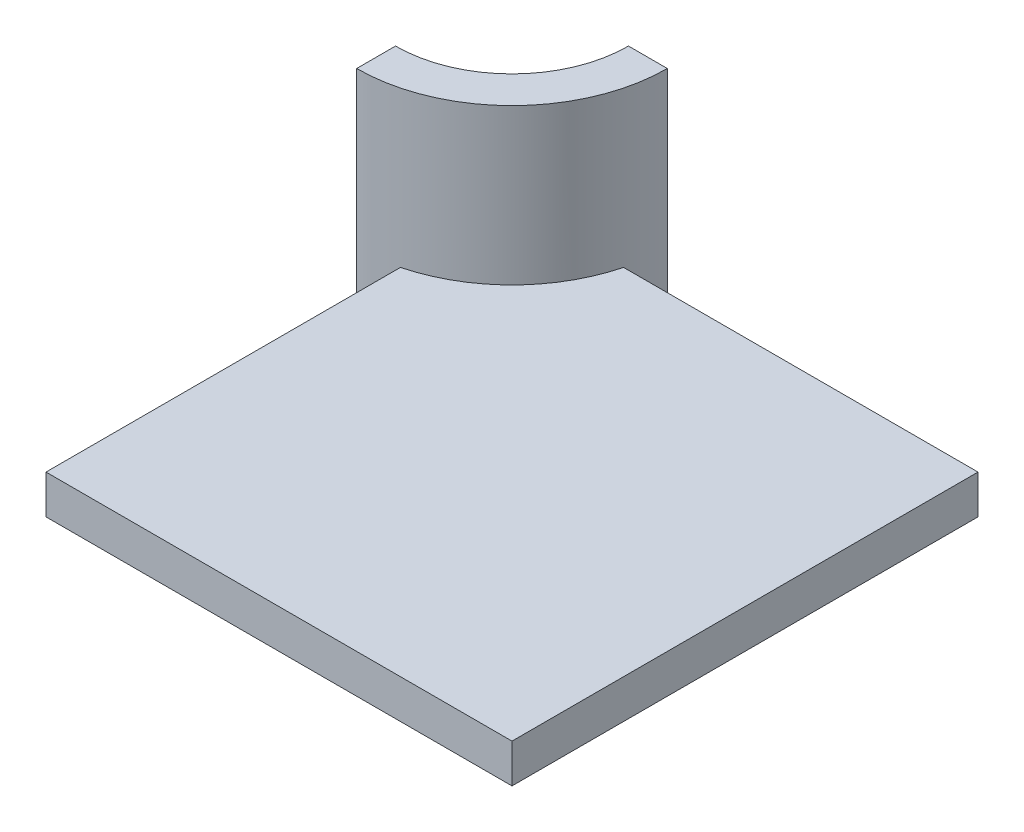
ISO-10303-21;
HEADER;
FILE_DESCRIPTION(('STEP AP214'),'2;1');
FILE_NAME('part.step','',(''),(''),'','','');
FILE_SCHEMA(('AUTOMOTIVE_DESIGN { 1 0 10303 214 1 1 1 1 }'));
ENDSEC;
DATA;
#1=APPLICATION_CONTEXT('core data for automotive mechanical design processes');
#2=APPLICATION_PROTOCOL_DEFINITION('international standard','automotive_design',2000,#1);
#3=PRODUCT_CONTEXT('',#1,'mechanical');
#4=PRODUCT('Part','Part','',(#3));
#5=PRODUCT_RELATED_PRODUCT_CATEGORY('part','',(#4));
#6=PRODUCT_DEFINITION_FORMATION('','',#4);
#7=PRODUCT_DEFINITION_CONTEXT('part definition',#1,'design');
#8=PRODUCT_DEFINITION('design','',#6,#7);
#9=PRODUCT_DEFINITION_SHAPE('','',#8);
#10=(LENGTH_UNIT() NAMED_UNIT(*) SI_UNIT(.MILLI.,.METRE.));
#11=(NAMED_UNIT(*) PLANE_ANGLE_UNIT() SI_UNIT($,.RADIAN.));
#12=(NAMED_UNIT(*) SI_UNIT($,.STERADIAN.) SOLID_ANGLE_UNIT());
#13=UNCERTAINTY_MEASURE_WITH_UNIT(LENGTH_MEASURE(1.E-05),#10,'distance_accuracy_value','');
#14=(GEOMETRIC_REPRESENTATION_CONTEXT(3) GLOBAL_UNCERTAINTY_ASSIGNED_CONTEXT((#13)) GLOBAL_UNIT_ASSIGNED_CONTEXT((#10,
#11,#12)) REPRESENTATION_CONTEXT('',''));
#15=CARTESIAN_POINT('',(0.,0.,0.));
#16=DIRECTION('',(0.,0.,1.));
#17=DIRECTION('',(1.,0.,0.));
#18=AXIS2_PLACEMENT_3D('',#15,#16,#17);
#19=CARTESIAN_POINT('',(-1.25,-0.05,-1.));
#20=DIRECTION('',(0.,1.,0.));
#21=DIRECTION('',(0.,0.,-1.));
#22=AXIS2_PLACEMENT_3D('',#19,#20,#21);
#23=CYLINDRICAL_SURFACE('',#22,0.2);
#24=DIRECTION('',(0.,1.,0.));
#25=VECTOR('',#24,1.);
#26=CARTESIAN_POINT('',(-1.05635083268963,-0.898528137423858,-0.95));
#27=LINE('',#26,#25);
#28=CARTESIAN_POINT('',(-1.05635083268963,-0.05,-0.95));
#29=VERTEX_POINT('',#28);
#30=CARTESIAN_POINT('',(-1.05635083268963,0.,-0.95));
#31=VERTEX_POINT('',#30);
#32=EDGE_CURVE('E11',#29,#31,#27,.T.);
#33=ORIENTED_EDGE('',*,*,#32,.F.);
#34=CARTESIAN_POINT('',(-1.25,-0.05,-1.));
#35=DIRECTION('',(0.,-1.,0.));
#36=DIRECTION('',(0.,0.,1.));
#37=AXIS2_PLACEMENT_3D('',#34,#35,#36);
#38=CIRCLE('',#37,0.2);
#39=CARTESIAN_POINT('',(-1.05,-0.05,-1.));
#40=VERTEX_POINT('',#39);
#41=EDGE_CURVE('E24',#40,#29,#38,.T.);
#42=ORIENTED_EDGE('',*,*,#41,.F.);
#43=DIRECTION('',(0.,1.,0.));
#44=VECTOR('',#43,1.);
#45=CARTESIAN_POINT('',(-1.05,-0.05,-1.));
#46=LINE('',#45,#44);
#47=CARTESIAN_POINT('',(-1.05,0.2,-1.));
#48=VERTEX_POINT('',#47);
#49=EDGE_CURVE('E158',#40,#48,#46,.T.);
#50=ORIENTED_EDGE('',*,*,#49,.T.);
#51=CARTESIAN_POINT('',(-1.25,0.2,-1.));
#52=DIRECTION('',(0.,-1.,0.));
#53=DIRECTION('',(0.,0.,1.));
#54=AXIS2_PLACEMENT_3D('',#51,#52,#53);
#55=CIRCLE('',#54,0.2);
#56=CARTESIAN_POINT('',(-1.25,0.2,-0.8));
#57=VERTEX_POINT('',#56);
#58=EDGE_CURVE('E156',#48,#57,#55,.T.);
#59=ORIENTED_EDGE('',*,*,#58,.T.);
#60=DIRECTION('',(0.,1.,0.));
#61=VECTOR('',#60,1.);
#62=CARTESIAN_POINT('',(-1.25,-0.05,-0.8));
#63=LINE('',#62,#61);
#64=CARTESIAN_POINT('',(-1.25,-0.05,-0.8));
#65=VERTEX_POINT('',#64);
#66=EDGE_CURVE('E153',#65,#57,#63,.T.);
#67=ORIENTED_EDGE('',*,*,#66,.F.);
#68=CARTESIAN_POINT('',(-1.25,-0.05,-1.));
#69=DIRECTION('',(0.,-1.,0.));
#70=DIRECTION('',(0.,0.,1.));
#71=AXIS2_PLACEMENT_3D('',#68,#69,#70);
#72=CIRCLE('',#71,0.2);
#73=CARTESIAN_POINT('',(-1.2,-0.05,-0.806350832689629));
#74=VERTEX_POINT('',#73);
#75=EDGE_CURVE('E150',#74,#65,#72,.T.);
#76=ORIENTED_EDGE('',*,*,#75,.F.);
#77=DIRECTION('',(0.,1.,0.));
#78=VECTOR('',#77,1.);
#79=CARTESIAN_POINT('',(-1.2,-0.898528137423858,-0.806350832689629));
#80=LINE('',#79,#78);
#81=CARTESIAN_POINT('',(-1.2,0.,-0.806350832689629));
#82=VERTEX_POINT('',#81);
#83=EDGE_CURVE('E148',#74,#82,#80,.T.);
#84=ORIENTED_EDGE('',*,*,#83,.T.);
#85=CARTESIAN_POINT('',(-1.25,0.,-1.));
#86=DIRECTION('',(0.,1.,0.));
#87=DIRECTION('',(0.,0.,1.));
#88=AXIS2_PLACEMENT_3D('',#85,#86,#87);
#89=CIRCLE('',#88,0.2);
#90=EDGE_CURVE('E107',#82,#31,#89,.T.);
#91=ORIENTED_EDGE('',*,*,#90,.T.);
#92=EDGE_LOOP('',(#33,#42,#50,#59,#67,#76,#84,#91));
#93=FACE_BOUND('',#92,.T.);
#94=ADVANCED_FACE('F17',(#93),#23,.T.);
#95=CARTESIAN_POINT('',(-1.25,-0.05,-1.));
#96=DIRECTION('',(0.,1.,0.));
#97=DIRECTION('',(0.,0.,-1.));
#98=AXIS2_PLACEMENT_3D('',#95,#96,#97);
#99=CYLINDRICAL_SURFACE('',#98,0.15);
#100=DIRECTION('',(0.,1.,0.));
#101=VECTOR('',#100,1.);
#102=CARTESIAN_POINT('',(-1.25,-0.05,-0.85));
#103=LINE('',#102,#101);
#104=CARTESIAN_POINT('',(-1.25,-0.05,-0.85));
#105=VERTEX_POINT('',#104);
#106=CARTESIAN_POINT('',(-1.25,0.2,-0.85));
#107=VERTEX_POINT('',#106);
#108=EDGE_CURVE('E144',#105,#107,#103,.T.);
#109=ORIENTED_EDGE('',*,*,#108,.T.);
#110=CARTESIAN_POINT('',(-1.25,0.2,-1.));
#111=DIRECTION('',(0.,1.,0.));
#112=DIRECTION('',(0.,0.,1.));
#113=AXIS2_PLACEMENT_3D('',#110,#111,#112);
#114=CIRCLE('',#113,0.15);
#115=CARTESIAN_POINT('',(-1.1,0.2,-1.));
#116=VERTEX_POINT('',#115);
#117=EDGE_CURVE('E141',#107,#116,#114,.T.);
#118=ORIENTED_EDGE('',*,*,#117,.T.);
#119=DIRECTION('',(0.,1.,0.));
#120=VECTOR('',#119,1.);
#121=CARTESIAN_POINT('',(-1.1,-0.05,-1.));
#122=LINE('',#121,#120);
#123=CARTESIAN_POINT('',(-1.1,-0.05,-1.));
#124=VERTEX_POINT('',#123);
#125=EDGE_CURVE('E139',#124,#116,#122,.T.);
#126=ORIENTED_EDGE('',*,*,#125,.F.);
#127=CARTESIAN_POINT('',(-1.25,-0.05,-1.));
#128=DIRECTION('',(0.,1.,0.));
#129=DIRECTION('',(0.,0.,1.));
#130=AXIS2_PLACEMENT_3D('',#127,#128,#129);
#131=CIRCLE('',#130,0.15);
#132=EDGE_CURVE('E137',#105,#124,#131,.T.);
#133=ORIENTED_EDGE('',*,*,#132,.F.);
#134=EDGE_LOOP('',(#109,#118,#126,#133));
#135=FACE_BOUND('',#134,.T.);
#136=ADVANCED_FACE('F174',(#135),#99,.F.);
#137=CARTESIAN_POINT('',(-1.05,-0.05,-1.));
#138=DIRECTION('',(0.,0.,1.));
#139=DIRECTION('',(1.,0.,0.));
#140=AXIS2_PLACEMENT_3D('',#137,#138,#139);
#141=PLANE('',#140);
#142=ORIENTED_EDGE('',*,*,#125,.T.);
#143=DIRECTION('',(1.,0.,0.));
#144=VECTOR('',#143,1.);
#145=CARTESIAN_POINT('',(-1.05,0.2,-1.));
#146=LINE('',#145,#144);
#147=EDGE_CURVE('E134',#116,#48,#146,.T.);
#148=ORIENTED_EDGE('',*,*,#147,.T.);
#149=ORIENTED_EDGE('',*,*,#49,.F.);
#150=DIRECTION('',(1.,0.,0.));
#151=VECTOR('',#150,1.);
#152=CARTESIAN_POINT('',(-1.05,-0.05,-1.));
#153=LINE('',#152,#151);
#154=EDGE_CURVE('E131',#124,#40,#153,.T.);
#155=ORIENTED_EDGE('',*,*,#154,.F.);
#156=EDGE_LOOP('',(#142,#148,#149,#155));
#157=FACE_BOUND('',#156,.T.);
#158=ADVANCED_FACE('F178',(#157),#141,.F.);
#159=CARTESIAN_POINT('',(-1.25,-0.05,-0.85));
#160=DIRECTION('',(1.,0.,0.));
#161=DIRECTION('',(0.,0.,-1.));
#162=AXIS2_PLACEMENT_3D('',#159,#160,#161);
#163=PLANE('',#162);
#164=ORIENTED_EDGE('',*,*,#66,.T.);
#165=DIRECTION('',(0.,0.,-1.));
#166=VECTOR('',#165,1.);
#167=CARTESIAN_POINT('',(-1.25,0.2,-0.85));
#168=LINE('',#167,#166);
#169=EDGE_CURVE('E128',#57,#107,#168,.T.);
#170=ORIENTED_EDGE('',*,*,#169,.T.);
#171=ORIENTED_EDGE('',*,*,#108,.F.);
#172=DIRECTION('',(0.,0.,-1.));
#173=VECTOR('',#172,1.);
#174=CARTESIAN_POINT('',(-1.25,-0.05,-0.85));
#175=LINE('',#174,#173);
#176=EDGE_CURVE('E125',#65,#105,#175,.T.);
#177=ORIENTED_EDGE('',*,*,#176,.F.);
#178=EDGE_LOOP('',(#164,#170,#171,#177));
#179=FACE_BOUND('',#178,.T.);
#180=ADVANCED_FACE('F171',(#179),#163,.F.);
#181=CARTESIAN_POINT('',(-1.25,-0.05,-1.));
#182=DIRECTION('',(0.,-1.,0.));
#183=DIRECTION('',(0.,0.,1.));
#184=AXIS2_PLACEMENT_3D('',#181,#182,#183);
#185=PLANE('',#184);
#186=ORIENTED_EDGE('',*,*,#132,.T.);
#187=ORIENTED_EDGE('',*,*,#154,.T.);
#188=ORIENTED_EDGE('',*,*,#41,.T.);
#189=DIRECTION('',(1.,0.,0.));
#190=VECTOR('',#189,1.);
#191=CARTESIAN_POINT('',(-1.05635083268963,-0.05,-0.95));
#192=LINE('',#191,#190);
#193=CARTESIAN_POINT('',(-0.6,-0.05,-0.95));
#194=VERTEX_POINT('',#193);
#195=EDGE_CURVE('E123',#29,#194,#192,.T.);
#196=ORIENTED_EDGE('',*,*,#195,.T.);
#197=DIRECTION('',(0.,0.,1.));
#198=VECTOR('',#197,1.);
#199=CARTESIAN_POINT('',(-0.6,-0.05,-0.95));
#200=LINE('',#199,#198);
#201=CARTESIAN_POINT('',(-0.6,-0.05,-0.35));
#202=VERTEX_POINT('',#201);
#203=EDGE_CURVE('E121',#194,#202,#200,.T.);
#204=ORIENTED_EDGE('',*,*,#203,.T.);
#205=DIRECTION('',(-1.,0.,0.));
#206=VECTOR('',#205,1.);
#207=CARTESIAN_POINT('',(-0.6,-0.05,-0.35));
#208=LINE('',#207,#206);
#209=CARTESIAN_POINT('',(-1.2,-0.05,-0.35));
#210=VERTEX_POINT('',#209);
#211=EDGE_CURVE('E119',#202,#210,#208,.T.);
#212=ORIENTED_EDGE('',*,*,#211,.T.);
#213=DIRECTION('',(0.,0.,-1.));
#214=VECTOR('',#213,1.);
#215=CARTESIAN_POINT('',(-1.2,-0.05,-0.35));
#216=LINE('',#215,#214);
#217=EDGE_CURVE('E102',#210,#74,#216,.T.);
#218=ORIENTED_EDGE('',*,*,#217,.T.);
#219=ORIENTED_EDGE('',*,*,#75,.T.);
#220=ORIENTED_EDGE('',*,*,#176,.T.);
#221=EDGE_LOOP('',(#186,#187,#188,#196,#204,#212,#218,#219,#220));
#222=FACE_BOUND('',#221,.T.);
#223=ADVANCED_FACE('F160',(#222),#185,.T.);
#224=CARTESIAN_POINT('',(-1.25,0.2,-1.));
#225=DIRECTION('',(0.,-1.,0.));
#226=DIRECTION('',(0.,0.,1.));
#227=AXIS2_PLACEMENT_3D('',#224,#225,#226);
#228=PLANE('',#227);
#229=ORIENTED_EDGE('',*,*,#117,.F.);
#230=ORIENTED_EDGE('',*,*,#169,.F.);
#231=ORIENTED_EDGE('',*,*,#58,.F.);
#232=ORIENTED_EDGE('',*,*,#147,.F.);
#233=EDGE_LOOP('',(#229,#230,#231,#232));
#234=FACE_BOUND('',#233,.T.);
#235=ADVANCED_FACE('F181',(#234),#228,.F.);
#236=CARTESIAN_POINT('',(-1.05635083268963,-0.898528137423858,-0.95));
#237=DIRECTION('',(0.,0.,1.));
#238=DIRECTION('',(1.,0.,0.));
#239=AXIS2_PLACEMENT_3D('',#236,#237,#238);
#240=PLANE('',#239);
#241=ORIENTED_EDGE('',*,*,#195,.F.);
#242=ORIENTED_EDGE('',*,*,#32,.T.);
#243=DIRECTION('',(1.,0.,0.));
#244=VECTOR('',#243,1.);
#245=CARTESIAN_POINT('',(-1.05635083268963,0.,-0.95));
#246=LINE('',#245,#244);
#247=CARTESIAN_POINT('',(-0.6,0.,-0.95));
#248=VERTEX_POINT('',#247);
#249=EDGE_CURVE('E116',#31,#248,#246,.T.);
#250=ORIENTED_EDGE('',*,*,#249,.T.);
#251=DIRECTION('',(0.,1.,0.));
#252=VECTOR('',#251,1.);
#253=CARTESIAN_POINT('',(-0.6,-0.898528137423858,-0.95));
#254=LINE('',#253,#252);
#255=EDGE_CURVE('E113',#194,#248,#254,.T.);
#256=ORIENTED_EDGE('',*,*,#255,.F.);
#257=EDGE_LOOP('',(#241,#242,#250,#256));
#258=FACE_BOUND('',#257,.T.);
#259=ADVANCED_FACE('F165',(#258),#240,.F.);
#260=CARTESIAN_POINT('',(-0.6,-0.898528137423858,-0.95));
#261=DIRECTION('',(-1.,0.,0.));
#262=DIRECTION('',(0.,0.,1.));
#263=AXIS2_PLACEMENT_3D('',#260,#261,#262);
#264=PLANE('',#263);
#265=ORIENTED_EDGE('',*,*,#203,.F.);
#266=ORIENTED_EDGE('',*,*,#255,.T.);
#267=DIRECTION('',(0.,0.,1.));
#268=VECTOR('',#267,1.);
#269=CARTESIAN_POINT('',(-0.6,0.,-0.95));
#270=LINE('',#269,#268);
#271=CARTESIAN_POINT('',(-0.6,0.,-0.35));
#272=VERTEX_POINT('',#271);
#273=EDGE_CURVE('E111',#248,#272,#270,.T.);
#274=ORIENTED_EDGE('',*,*,#273,.T.);
#275=DIRECTION('',(0.,1.,0.));
#276=VECTOR('',#275,1.);
#277=CARTESIAN_POINT('',(-0.6,-0.898528137423858,-0.35));
#278=LINE('',#277,#276);
#279=EDGE_CURVE('E90',#202,#272,#278,.T.);
#280=ORIENTED_EDGE('',*,*,#279,.F.);
#281=EDGE_LOOP('',(#265,#266,#274,#280));
#282=FACE_BOUND('',#281,.T.);
#283=ADVANCED_FACE('F167',(#282),#264,.F.);
#284=CARTESIAN_POINT('',(-0.6,-0.898528137423858,-0.35));
#285=DIRECTION('',(0.,0.,-1.));
#286=DIRECTION('',(-1.,0.,0.));
#287=AXIS2_PLACEMENT_3D('',#284,#285,#286);
#288=PLANE('',#287);
#289=ORIENTED_EDGE('',*,*,#211,.F.);
#290=ORIENTED_EDGE('',*,*,#279,.T.);
#291=DIRECTION('',(-1.,0.,0.));
#292=VECTOR('',#291,1.);
#293=CARTESIAN_POINT('',(-0.6,0.,-0.35));
#294=LINE('',#293,#292);
#295=CARTESIAN_POINT('',(-1.2,0.,-0.35));
#296=VERTEX_POINT('',#295);
#297=EDGE_CURVE('E84',#272,#296,#294,.T.);
#298=ORIENTED_EDGE('',*,*,#297,.T.);
#299=DIRECTION('',(0.,1.,0.));
#300=VECTOR('',#299,1.);
#301=CARTESIAN_POINT('',(-1.2,-0.898528137423858,-0.35));
#302=LINE('',#301,#300);
#303=EDGE_CURVE('E88',#210,#296,#302,.T.);
#304=ORIENTED_EDGE('',*,*,#303,.F.);
#305=EDGE_LOOP('',(#289,#290,#298,#304));
#306=FACE_BOUND('',#305,.T.);
#307=ADVANCED_FACE('F87',(#306),#288,.F.);
#308=CARTESIAN_POINT('',(-1.2,-0.898528137423858,-0.35));
#309=DIRECTION('',(1.,0.,0.));
#310=DIRECTION('',(0.,0.,-1.));
#311=AXIS2_PLACEMENT_3D('',#308,#309,#310);
#312=PLANE('',#311);
#313=ORIENTED_EDGE('',*,*,#217,.F.);
#314=ORIENTED_EDGE('',*,*,#303,.T.);
#315=DIRECTION('',(0.,0.,-1.));
#316=VECTOR('',#315,1.);
#317=CARTESIAN_POINT('',(-1.2,0.,-0.35));
#318=LINE('',#317,#316);
#319=EDGE_CURVE('E100',#296,#82,#318,.T.);
#320=ORIENTED_EDGE('',*,*,#319,.T.);
#321=ORIENTED_EDGE('',*,*,#83,.F.);
#322=EDGE_LOOP('',(#313,#314,#320,#321));
#323=FACE_BOUND('',#322,.T.);
#324=ADVANCED_FACE('F98',(#323),#312,.F.);
#325=CARTESIAN_POINT('',(-1.25,0.,-1.));
#326=DIRECTION('',(0.,-1.,0.));
#327=DIRECTION('',(0.,0.,1.));
#328=AXIS2_PLACEMENT_3D('',#325,#326,#327);
#329=PLANE('',#328);
#330=ORIENTED_EDGE('',*,*,#90,.F.);
#331=ORIENTED_EDGE('',*,*,#319,.F.);
#332=ORIENTED_EDGE('',*,*,#297,.F.);
#333=ORIENTED_EDGE('',*,*,#273,.F.);
#334=ORIENTED_EDGE('',*,*,#249,.F.);
#335=EDGE_LOOP('',(#330,#331,#332,#333,#334));
#336=FACE_BOUND('',#335,.T.);
#337=ADVANCED_FACE('F105',(#336),#329,.F.);
#338=CLOSED_SHELL('',(#94,#136,#158,#180,#223,#235,#259,#283,#307,#324,#337));
#339=MANIFOLD_SOLID_BREP('B1',#338);
#340=ADVANCED_BREP_SHAPE_REPRESENTATION('',(#18,#339),#14);
#341=SHAPE_DEFINITION_REPRESENTATION(#9,#340);
ENDSEC;
END-ISO-10303-21;
